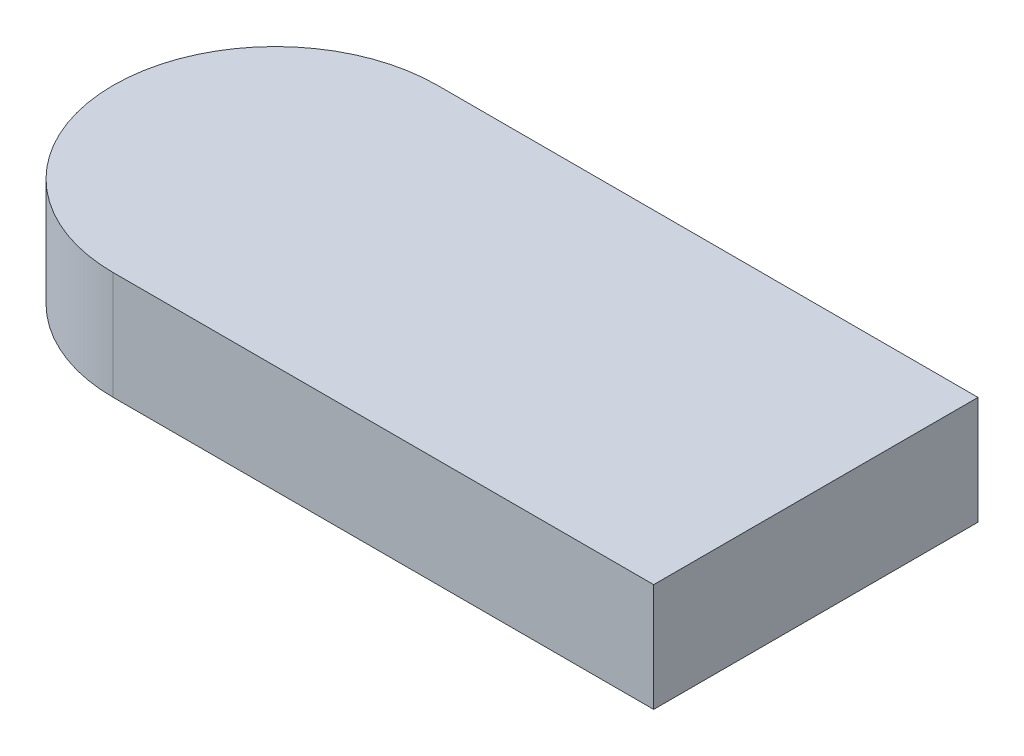
ISO-10303-21;
HEADER;
FILE_DESCRIPTION(('STEP AP214'),'2;1');
FILE_NAME('part.step','',(''),(''),'','','');
FILE_SCHEMA(('AUTOMOTIVE_DESIGN { 1 0 10303 214 1 1 1 1 }'));
ENDSEC;
DATA;
#1=APPLICATION_CONTEXT('core data for automotive mechanical design processes');
#2=APPLICATION_PROTOCOL_DEFINITION('international standard','automotive_design',2000,#1);
#3=PRODUCT_CONTEXT('',#1,'mechanical');
#4=PRODUCT('Part','Part','',(#3));
#5=PRODUCT_RELATED_PRODUCT_CATEGORY('part','',(#4));
#6=PRODUCT_DEFINITION_FORMATION('','',#4);
#7=PRODUCT_DEFINITION_CONTEXT('part definition',#1,'design');
#8=PRODUCT_DEFINITION('design','',#6,#7);
#9=PRODUCT_DEFINITION_SHAPE('','',#8);
#10=(LENGTH_UNIT() NAMED_UNIT(*) SI_UNIT(.MILLI.,.METRE.));
#11=(NAMED_UNIT(*) PLANE_ANGLE_UNIT() SI_UNIT($,.RADIAN.));
#12=(NAMED_UNIT(*) SI_UNIT($,.STERADIAN.) SOLID_ANGLE_UNIT());
#13=UNCERTAINTY_MEASURE_WITH_UNIT(LENGTH_MEASURE(1.E-05),#10,'distance_accuracy_value','');
#14=(GEOMETRIC_REPRESENTATION_CONTEXT(3) GLOBAL_UNCERTAINTY_ASSIGNED_CONTEXT((#13)) GLOBAL_UNIT_ASSIGNED_CONTEXT((#10,
#11,#12)) REPRESENTATION_CONTEXT('',''));
#15=CARTESIAN_POINT('',(0.,0.,0.));
#16=DIRECTION('',(0.,0.,1.));
#17=DIRECTION('',(1.,0.,0.));
#18=AXIS2_PLACEMENT_3D('',#15,#16,#17);
#19=CARTESIAN_POINT('',(-75.,15.,0.));
#20=DIRECTION('',(0.,-1.,0.));
#21=DIRECTION('',(0.,0.,-1.));
#22=AXIS2_PLACEMENT_3D('',#19,#20,#21);
#23=CYLINDRICAL_SURFACE('',#22,45.);
#24=CARTESIAN_POINT('',(-75.,-15.,0.));
#25=DIRECTION('',(0.,1.,0.));
#26=DIRECTION('',(0.,0.,1.));
#27=AXIS2_PLACEMENT_3D('',#24,#25,#26);
#28=CIRCLE('',#27,45.);
#29=CARTESIAN_POINT('',(-75.,-15.,-45.));
#30=VERTEX_POINT('',#29);
#31=CARTESIAN_POINT('',(-75.,-15.,45.));
#32=VERTEX_POINT('',#31);
#33=EDGE_CURVE('E98',#30,#32,#28,.T.);
#34=ORIENTED_EDGE('',*,*,#33,.T.);
#35=DIRECTION('',(0.,-1.,0.));
#36=VECTOR('',#35,1.);
#37=CARTESIAN_POINT('',(-75.,15.,45.));
#38=LINE('',#37,#36);
#39=CARTESIAN_POINT('',(-75.,15.,45.));
#40=VERTEX_POINT('',#39);
#41=EDGE_CURVE('E11',#40,#32,#38,.T.);
#42=ORIENTED_EDGE('',*,*,#41,.F.);
#43=CARTESIAN_POINT('',(-75.,15.,0.));
#44=DIRECTION('',(0.,1.,0.));
#45=DIRECTION('',(0.,0.,1.));
#46=AXIS2_PLACEMENT_3D('',#43,#44,#45);
#47=CIRCLE('',#46,45.);
#48=CARTESIAN_POINT('',(-75.,15.,-45.));
#49=VERTEX_POINT('',#48);
#50=EDGE_CURVE('E84',#49,#40,#47,.T.);
#51=ORIENTED_EDGE('',*,*,#50,.F.);
#52=DIRECTION('',(0.,-1.,0.));
#53=VECTOR('',#52,1.);
#54=CARTESIAN_POINT('',(-75.,15.,-45.));
#55=LINE('',#54,#53);
#56=EDGE_CURVE('E51',#49,#30,#55,.T.);
#57=ORIENTED_EDGE('',*,*,#56,.T.);
#58=EDGE_LOOP('',(#34,#42,#51,#57));
#59=FACE_BOUND('',#58,.T.);
#60=ADVANCED_FACE('F35',(#59),#23,.T.);
#61=CARTESIAN_POINT('',(-75.,15.,45.));
#62=DIRECTION('',(0.,0.,-1.));
#63=DIRECTION('',(-1.,0.,0.));
#64=AXIS2_PLACEMENT_3D('',#61,#62,#63);
#65=PLANE('',#64);
#66=DIRECTION('',(1.,0.,0.));
#67=VECTOR('',#66,1.);
#68=CARTESIAN_POINT('',(-75.,-15.,45.));
#69=LINE('',#68,#67);
#70=CARTESIAN_POINT('',(75.,-15.,45.));
#71=VERTEX_POINT('',#70);
#72=EDGE_CURVE('E89',#32,#71,#69,.T.);
#73=ORIENTED_EDGE('',*,*,#72,.T.);
#74=DIRECTION('',(0.,-1.,0.));
#75=VECTOR('',#74,1.);
#76=CARTESIAN_POINT('',(75.,15.,45.));
#77=LINE('',#76,#75);
#78=CARTESIAN_POINT('',(75.,15.,45.));
#79=VERTEX_POINT('',#78);
#80=EDGE_CURVE('E43',#79,#71,#77,.T.);
#81=ORIENTED_EDGE('',*,*,#80,.F.);
#82=DIRECTION('',(1.,0.,0.));
#83=VECTOR('',#82,1.);
#84=CARTESIAN_POINT('',(-75.,15.,45.));
#85=LINE('',#84,#83);
#86=EDGE_CURVE('E76',#40,#79,#85,.T.);
#87=ORIENTED_EDGE('',*,*,#86,.F.);
#88=ORIENTED_EDGE('',*,*,#41,.T.);
#89=EDGE_LOOP('',(#73,#81,#87,#88));
#90=FACE_BOUND('',#89,.T.);
#91=ADVANCED_FACE('F88',(#90),#65,.F.);
#92=CARTESIAN_POINT('',(75.,15.,-45.));
#93=DIRECTION('',(1.,0.,0.));
#94=DIRECTION('',(0.,0.,-1.));
#95=AXIS2_PLACEMENT_3D('',#92,#93,#94);
#96=PLANE('',#95);
#97=DIRECTION('',(0.,0.,1.));
#98=VECTOR('',#97,1.);
#99=CARTESIAN_POINT('',(75.,-15.,-45.));
#100=LINE('',#99,#98);
#101=CARTESIAN_POINT('',(75.,-15.,-45.));
#102=VERTEX_POINT('',#101);
#103=EDGE_CURVE('E101',#102,#71,#100,.T.);
#104=ORIENTED_EDGE('',*,*,#103,.F.);
#105=DIRECTION('',(0.,-1.,0.));
#106=VECTOR('',#105,1.);
#107=CARTESIAN_POINT('',(75.,15.,-45.));
#108=LINE('',#107,#106);
#109=CARTESIAN_POINT('',(75.,15.,-45.));
#110=VERTEX_POINT('',#109);
#111=EDGE_CURVE('E65',#110,#102,#108,.T.);
#112=ORIENTED_EDGE('',*,*,#111,.F.);
#113=DIRECTION('',(0.,0.,1.));
#114=VECTOR('',#113,1.);
#115=CARTESIAN_POINT('',(75.,15.,-45.));
#116=LINE('',#115,#114);
#117=EDGE_CURVE('E83',#110,#79,#116,.T.);
#118=ORIENTED_EDGE('',*,*,#117,.T.);
#119=ORIENTED_EDGE('',*,*,#80,.T.);
#120=EDGE_LOOP('',(#104,#112,#118,#119));
#121=FACE_BOUND('',#120,.T.);
#122=ADVANCED_FACE('F92',(#121),#96,.T.);
#123=CARTESIAN_POINT('',(-75.,15.,-45.));
#124=DIRECTION('',(0.,0.,-1.));
#125=DIRECTION('',(-1.,0.,0.));
#126=AXIS2_PLACEMENT_3D('',#123,#124,#125);
#127=PLANE('',#126);
#128=DIRECTION('',(1.,0.,0.));
#129=VECTOR('',#128,1.);
#130=CARTESIAN_POINT('',(-75.,-15.,-45.));
#131=LINE('',#130,#129);
#132=EDGE_CURVE('E103',#30,#102,#131,.T.);
#133=ORIENTED_EDGE('',*,*,#132,.F.);
#134=ORIENTED_EDGE('',*,*,#56,.F.);
#135=DIRECTION('',(1.,0.,0.));
#136=VECTOR('',#135,1.);
#137=CARTESIAN_POINT('',(-75.,15.,-45.));
#138=LINE('',#137,#136);
#139=EDGE_CURVE('E93',#49,#110,#138,.T.);
#140=ORIENTED_EDGE('',*,*,#139,.T.);
#141=ORIENTED_EDGE('',*,*,#111,.T.);
#142=EDGE_LOOP('',(#133,#134,#140,#141));
#143=FACE_BOUND('',#142,.T.);
#144=ADVANCED_FACE('F109',(#143),#127,.T.);
#145=CARTESIAN_POINT('',(-75.,15.,0.));
#146=DIRECTION('',(0.,1.,0.));
#147=DIRECTION('',(0.,0.,1.));
#148=AXIS2_PLACEMENT_3D('',#145,#146,#147);
#149=PLANE('',#148);
#150=ORIENTED_EDGE('',*,*,#50,.T.);
#151=ORIENTED_EDGE('',*,*,#86,.T.);
#152=ORIENTED_EDGE('',*,*,#117,.F.);
#153=ORIENTED_EDGE('',*,*,#139,.F.);
#154=EDGE_LOOP('',(#150,#151,#152,#153));
#155=FACE_BOUND('',#154,.T.);
#156=ADVANCED_FACE('F80',(#155),#149,.T.);
#157=CARTESIAN_POINT('',(-75.,-15.,0.));
#158=DIRECTION('',(0.,1.,0.));
#159=DIRECTION('',(0.,0.,1.));
#160=AXIS2_PLACEMENT_3D('',#157,#158,#159);
#161=PLANE('',#160);
#162=ORIENTED_EDGE('',*,*,#33,.F.);
#163=ORIENTED_EDGE('',*,*,#132,.T.);
#164=ORIENTED_EDGE('',*,*,#103,.T.);
#165=ORIENTED_EDGE('',*,*,#72,.F.);
#166=EDGE_LOOP('',(#162,#163,#164,#165));
#167=FACE_BOUND('',#166,.T.);
#168=ADVANCED_FACE('F108',(#167),#161,.F.);
#169=CLOSED_SHELL('',(#60,#91,#122,#144,#156,#168));
#170=MANIFOLD_SOLID_BREP('B2',#169);
#171=ADVANCED_BREP_SHAPE_REPRESENTATION('',(#18,#170),#14);
#172=SHAPE_DEFINITION_REPRESENTATION(#9,#171);
ENDSEC;
END-ISO-10303-21;
